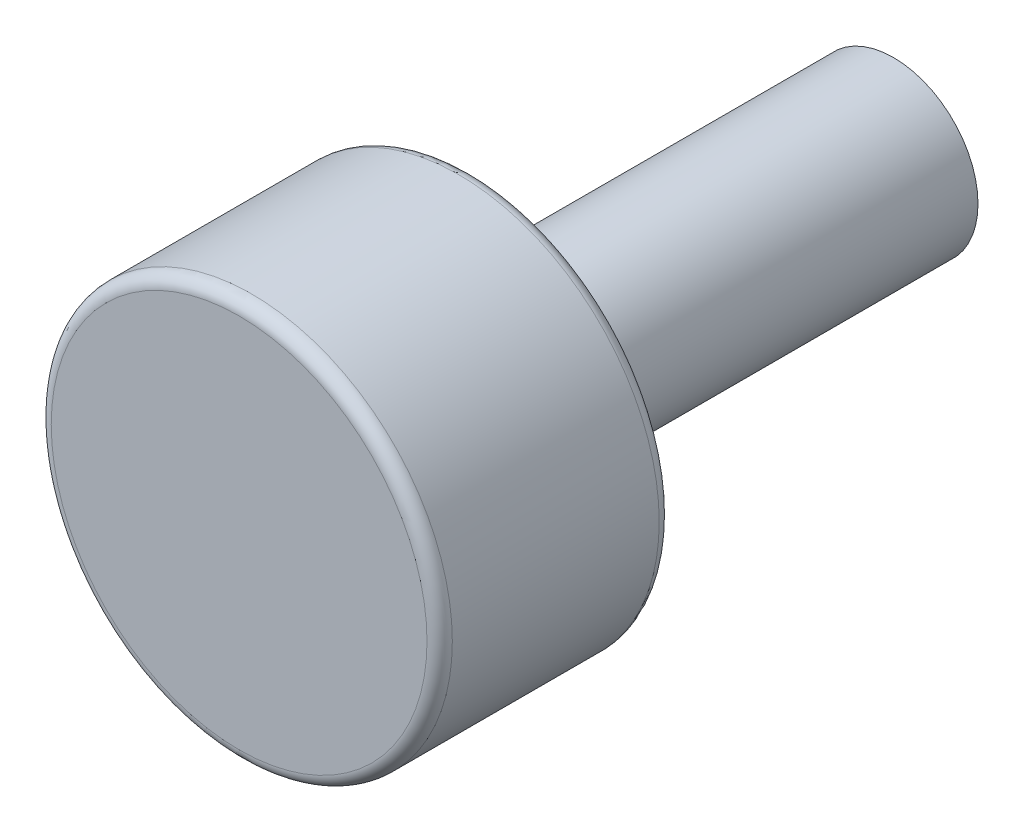
ISO-10303-21;
HEADER;
FILE_DESCRIPTION(('STEP AP214'),'2;1');
FILE_NAME('part.step','',(''),(''),'','','');
FILE_SCHEMA(('AUTOMOTIVE_DESIGN { 1 0 10303 214 1 1 1 1 }'));
ENDSEC;
DATA;
#1=APPLICATION_CONTEXT('core data for automotive mechanical design processes');
#2=APPLICATION_PROTOCOL_DEFINITION('international standard','automotive_design',2000,#1);
#3=PRODUCT_CONTEXT('',#1,'mechanical');
#4=PRODUCT('Part','Part','',(#3));
#5=PRODUCT_RELATED_PRODUCT_CATEGORY('part','',(#4));
#6=PRODUCT_DEFINITION_FORMATION('','',#4);
#7=PRODUCT_DEFINITION_CONTEXT('part definition',#1,'design');
#8=PRODUCT_DEFINITION('design','',#6,#7);
#9=PRODUCT_DEFINITION_SHAPE('','',#8);
#10=(LENGTH_UNIT() NAMED_UNIT(*) SI_UNIT(.MILLI.,.METRE.));
#11=(NAMED_UNIT(*) PLANE_ANGLE_UNIT() SI_UNIT($,.RADIAN.));
#12=(NAMED_UNIT(*) SI_UNIT($,.STERADIAN.) SOLID_ANGLE_UNIT());
#13=UNCERTAINTY_MEASURE_WITH_UNIT(LENGTH_MEASURE(1.E-05),#10,'distance_accuracy_value','');
#14=(GEOMETRIC_REPRESENTATION_CONTEXT(3) GLOBAL_UNCERTAINTY_ASSIGNED_CONTEXT((#13)) GLOBAL_UNIT_ASSIGNED_CONTEXT((#10,
#11,#12)) REPRESENTATION_CONTEXT('',''));
#15=CARTESIAN_POINT('',(0.,0.,0.));
#16=DIRECTION('',(0.,0.,1.));
#17=DIRECTION('',(1.,0.,0.));
#18=AXIS2_PLACEMENT_3D('',#15,#16,#17);
#19=CARTESIAN_POINT('',(0.,0.,11.));
#20=DIRECTION('',(0.,0.,-1.));
#21=DIRECTION('',(-1.,0.,0.));
#22=AXIS2_PLACEMENT_3D('',#19,#20,#21);
#23=CYLINDRICAL_SURFACE('',#22,9.5);
#24=CARTESIAN_POINT('',(0.,0.,0.6));
#25=DIRECTION('',(0.,0.,1.));
#26=DIRECTION('',(1.,0.,0.));
#27=AXIS2_PLACEMENT_3D('',#24,#25,#26);
#28=CIRCLE('',#27,9.5);
#29=CARTESIAN_POINT('',(9.5,0.,0.6));
#30=VERTEX_POINT('',#29);
#31=EDGE_CURVE('E38',#30,#30,#28,.T.);
#32=ORIENTED_EDGE('',*,*,#31,.T.);
#33=EDGE_LOOP('',(#32));
#34=FACE_BOUND('',#33,.T.);
#35=CARTESIAN_POINT('',(0.,0.,10.4));
#36=DIRECTION('',(0.,0.,1.));
#37=DIRECTION('',(1.,0.,0.));
#38=AXIS2_PLACEMENT_3D('',#35,#36,#37);
#39=CIRCLE('',#38,9.5);
#40=CARTESIAN_POINT('',(9.5,0.,10.4));
#41=VERTEX_POINT('',#40);
#42=EDGE_CURVE('E42',#41,#41,#39,.F.);
#43=ORIENTED_EDGE('',*,*,#42,.T.);
#44=EDGE_LOOP('',(#43));
#45=FACE_BOUND('',#44,.T.);
#46=ADVANCED_FACE('F31',(#34,#45),#23,.T.);
#47=CARTESIAN_POINT('',(0.,0.,11.));
#48=DIRECTION('',(0.,0.,1.));
#49=DIRECTION('',(1.,0.,0.));
#50=AXIS2_PLACEMENT_3D('',#47,#48,#49);
#51=PLANE('',#50);
#52=CARTESIAN_POINT('',(0.,0.,11.));
#53=DIRECTION('',(0.,0.,1.));
#54=DIRECTION('',(1.,0.,0.));
#55=AXIS2_PLACEMENT_3D('',#52,#53,#54);
#56=CIRCLE('',#55,8.9);
#57=CARTESIAN_POINT('',(8.9,0.,11.));
#58=VERTEX_POINT('',#57);
#59=EDGE_CURVE('E46',#58,#58,#56,.T.);
#60=ORIENTED_EDGE('',*,*,#59,.T.);
#61=EDGE_LOOP('',(#60));
#62=FACE_BOUND('',#61,.T.);
#63=ADVANCED_FACE('F68',(#62),#51,.T.);
#64=CARTESIAN_POINT('',(0.,0.,0.));
#65=DIRECTION('',(0.,0.,1.));
#66=DIRECTION('',(1.,0.,0.));
#67=AXIS2_PLACEMENT_3D('',#64,#65,#66);
#68=PLANE('',#67);
#69=CARTESIAN_POINT('',(0.,0.,0.));
#70=DIRECTION('',(0.,0.,1.));
#71=DIRECTION('',(1.,0.,0.));
#72=AXIS2_PLACEMENT_3D('',#69,#70,#71);
#73=CIRCLE('',#72,8.9);
#74=CARTESIAN_POINT('',(8.9,0.,0.));
#75=VERTEX_POINT('',#74);
#76=EDGE_CURVE('E10',#75,#75,#73,.F.);
#77=ORIENTED_EDGE('',*,*,#76,.T.);
#78=EDGE_LOOP('',(#77));
#79=FACE_BOUND('',#78,.T.);
#80=CARTESIAN_POINT('',(0.,0.,0.));
#81=DIRECTION('',(0.,0.,1.));
#82=DIRECTION('',(1.,0.,0.));
#83=AXIS2_PLACEMENT_3D('',#80,#81,#82);
#84=CIRCLE('',#83,4.);
#85=CARTESIAN_POINT('',(4.,0.,0.));
#86=VERTEX_POINT('',#85);
#87=EDGE_CURVE('E51',#86,#86,#84,.F.);
#88=ORIENTED_EDGE('',*,*,#87,.F.);
#89=EDGE_LOOP('',(#88));
#90=FACE_BOUND('',#89,.T.);
#91=ADVANCED_FACE('F63',(#79,#90),#68,.F.);
#92=CARTESIAN_POINT('',(0.,0.,-20.));
#93=DIRECTION('',(0.,0.,1.));
#94=DIRECTION('',(1.,0.,0.));
#95=AXIS2_PLACEMENT_3D('',#92,#93,#94);
#96=CYLINDRICAL_SURFACE('',#95,4.);
#97=CARTESIAN_POINT('',(0.,0.,-20.));
#98=DIRECTION('',(0.,0.,-1.));
#99=DIRECTION('',(-1.,0.,0.));
#100=AXIS2_PLACEMENT_3D('',#97,#98,#99);
#101=CIRCLE('',#100,4.);
#102=CARTESIAN_POINT('',(-4.,0.,-20.));
#103=VERTEX_POINT('',#102);
#104=EDGE_CURVE('E54',#103,#103,#101,.T.);
#105=ORIENTED_EDGE('',*,*,#104,.F.);
#106=EDGE_LOOP('',(#105));
#107=FACE_BOUND('',#106,.T.);
#108=ORIENTED_EDGE('',*,*,#87,.T.);
#109=EDGE_LOOP('',(#108));
#110=FACE_BOUND('',#109,.T.);
#111=ADVANCED_FACE('F60',(#107,#110),#96,.T.);
#112=CARTESIAN_POINT('',(0.,0.,-20.));
#113=DIRECTION('',(0.,0.,-1.));
#114=DIRECTION('',(-1.,0.,0.));
#115=AXIS2_PLACEMENT_3D('',#112,#113,#114);
#116=PLANE('',#115);
#117=ORIENTED_EDGE('',*,*,#104,.T.);
#118=EDGE_LOOP('',(#117));
#119=FACE_BOUND('',#118,.T.);
#120=ADVANCED_FACE('F58',(#119),#116,.T.);
#121=CARTESIAN_POINT('',(0.,0.,10.4));
#122=DIRECTION('',(0.,0.,1.));
#123=DIRECTION('',(1.,0.,0.));
#124=AXIS2_PLACEMENT_3D('',#121,#122,#123);
#125=TOROIDAL_SURFACE('',#124,8.9,0.6);
#126=ORIENTED_EDGE('',*,*,#42,.F.);
#127=EDGE_LOOP('',(#126));
#128=FACE_BOUND('',#127,.T.);
#129=ORIENTED_EDGE('',*,*,#59,.F.);
#130=EDGE_LOOP('',(#129));
#131=FACE_BOUND('',#130,.T.);
#132=ADVANCED_FACE('F80',(#128,#131),#125,.T.);
#133=CARTESIAN_POINT('',(0.,0.,0.6));
#134=DIRECTION('',(0.,0.,1.));
#135=DIRECTION('',(1.,0.,0.));
#136=AXIS2_PLACEMENT_3D('',#133,#134,#135);
#137=TOROIDAL_SURFACE('',#136,8.9,0.6);
#138=ORIENTED_EDGE('',*,*,#76,.F.);
#139=EDGE_LOOP('',(#138));
#140=FACE_BOUND('',#139,.T.);
#141=ORIENTED_EDGE('',*,*,#31,.F.);
#142=EDGE_LOOP('',(#141));
#143=FACE_BOUND('',#142,.T.);
#144=ADVANCED_FACE('F33',(#140,#143),#137,.T.);
#145=CLOSED_SHELL('',(#46,#63,#91,#111,#120,#132,#144));
#146=MANIFOLD_SOLID_BREP('B2',#145);
#147=ADVANCED_BREP_SHAPE_REPRESENTATION('',(#18,#146),#14);
#148=SHAPE_DEFINITION_REPRESENTATION(#9,#147);
ENDSEC;
END-ISO-10303-21;
